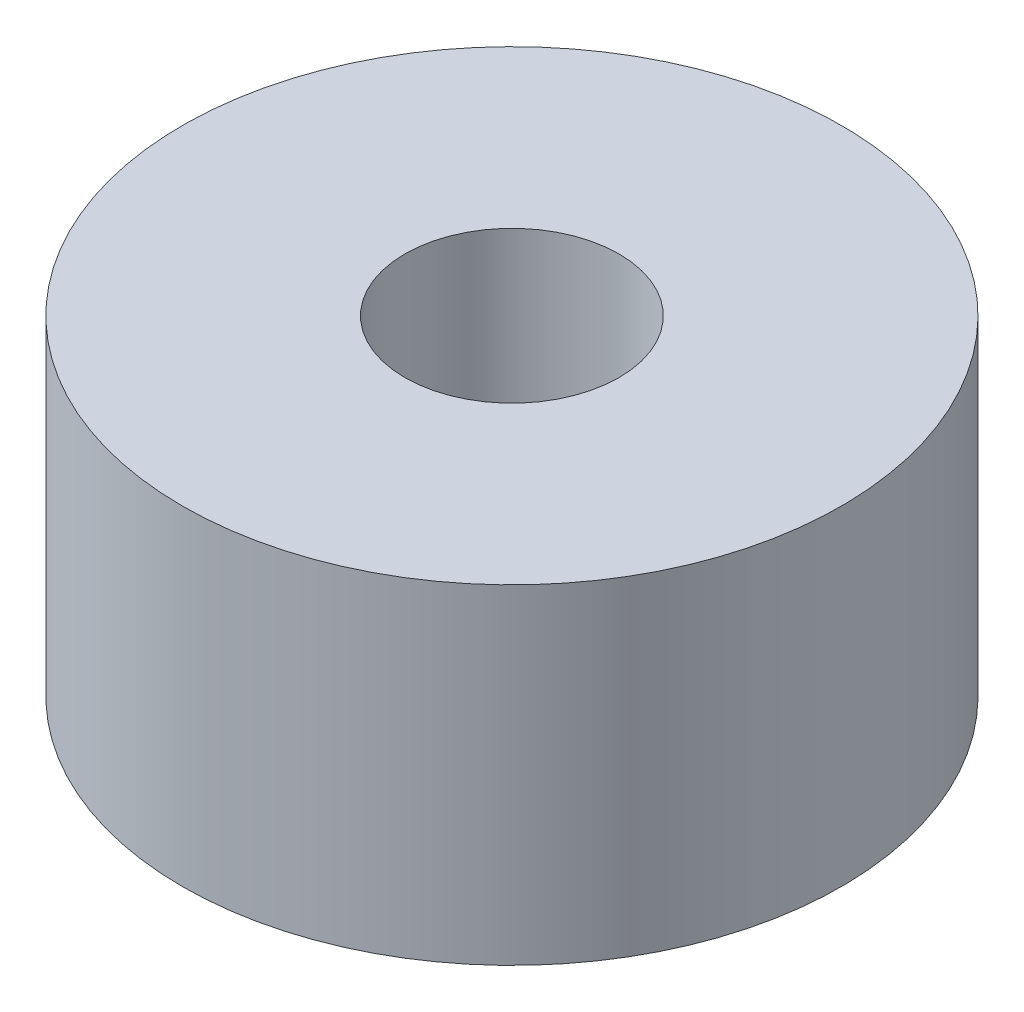
ISO-10303-21;
HEADER;
FILE_DESCRIPTION(('STEP AP214'),'2;1');
FILE_NAME('part.step','',(''),(''),'','','');
FILE_SCHEMA(('AUTOMOTIVE_DESIGN { 1 0 10303 214 1 1 1 1 }'));
ENDSEC;
DATA;
#1=APPLICATION_CONTEXT('core data for automotive mechanical design processes');
#2=APPLICATION_PROTOCOL_DEFINITION('international standard','automotive_design',2000,#1);
#3=PRODUCT_CONTEXT('',#1,'mechanical');
#4=PRODUCT('Part','Part','',(#3));
#5=PRODUCT_RELATED_PRODUCT_CATEGORY('part','',(#4));
#6=PRODUCT_DEFINITION_FORMATION('','',#4);
#7=PRODUCT_DEFINITION_CONTEXT('part definition',#1,'design');
#8=PRODUCT_DEFINITION('design','',#6,#7);
#9=PRODUCT_DEFINITION_SHAPE('','',#8);
#10=(LENGTH_UNIT() NAMED_UNIT(*) SI_UNIT(.MILLI.,.METRE.));
#11=(NAMED_UNIT(*) PLANE_ANGLE_UNIT() SI_UNIT($,.RADIAN.));
#12=(NAMED_UNIT(*) SI_UNIT($,.STERADIAN.) SOLID_ANGLE_UNIT());
#13=UNCERTAINTY_MEASURE_WITH_UNIT(LENGTH_MEASURE(1.E-05),#10,'distance_accuracy_value','');
#14=(GEOMETRIC_REPRESENTATION_CONTEXT(3) GLOBAL_UNCERTAINTY_ASSIGNED_CONTEXT((#13)) GLOBAL_UNIT_ASSIGNED_CONTEXT((#10,
#11,#12)) REPRESENTATION_CONTEXT('',''));
#15=CARTESIAN_POINT('',(0.,0.,0.));
#16=DIRECTION('',(0.,0.,1.));
#17=DIRECTION('',(1.,0.,0.));
#18=AXIS2_PLACEMENT_3D('',#15,#16,#17);
#19=CARTESIAN_POINT('',(0.,10.,0.));
#20=DIRECTION('',(0.,1.,0.));
#21=DIRECTION('',(0.,0.,1.));
#22=AXIS2_PLACEMENT_3D('',#19,#20,#21);
#23=PLANE('',#22);
#24=CARTESIAN_POINT('',(0.,10.,0.));
#25=DIRECTION('',(0.,1.,0.));
#26=DIRECTION('',(0.,0.,1.));
#27=AXIS2_PLACEMENT_3D('',#24,#25,#26);
#28=CIRCLE('',#27,10.);
#29=CARTESIAN_POINT('',(0.,10.,10.));
#30=VERTEX_POINT('',#29);
#31=EDGE_CURVE('E10',#30,#30,#28,.T.);
#32=ORIENTED_EDGE('',*,*,#31,.T.);
#33=EDGE_LOOP('',(#32));
#34=FACE_BOUND('',#33,.T.);
#35=CARTESIAN_POINT('',(0.,10.,0.));
#36=DIRECTION('',(0.,1.,0.));
#37=DIRECTION('',(0.,0.,1.));
#38=AXIS2_PLACEMENT_3D('',#35,#36,#37);
#39=CIRCLE('',#38,3.25);
#40=CARTESIAN_POINT('',(0.,10.,3.25));
#41=VERTEX_POINT('',#40);
#42=EDGE_CURVE('E50',#41,#41,#39,.T.);
#43=ORIENTED_EDGE('',*,*,#42,.F.);
#44=EDGE_LOOP('',(#43));
#45=FACE_BOUND('',#44,.T.);
#46=ADVANCED_FACE('F37',(#34,#45),#23,.T.);
#47=CARTESIAN_POINT('',(0.,0.,0.));
#48=DIRECTION('',(0.,1.,0.));
#49=DIRECTION('',(0.,0.,1.));
#50=AXIS2_PLACEMENT_3D('',#47,#48,#49);
#51=PLANE('',#50);
#52=CARTESIAN_POINT('',(0.,0.,0.));
#53=DIRECTION('',(0.,1.,0.));
#54=DIRECTION('',(0.,0.,1.));
#55=AXIS2_PLACEMENT_3D('',#52,#53,#54);
#56=CIRCLE('',#55,10.);
#57=CARTESIAN_POINT('',(0.,0.,10.));
#58=VERTEX_POINT('',#57);
#59=EDGE_CURVE('E41',#58,#58,#56,.T.);
#60=ORIENTED_EDGE('',*,*,#59,.F.);
#61=EDGE_LOOP('',(#60));
#62=FACE_BOUND('',#61,.T.);
#63=CARTESIAN_POINT('',(0.,0.,0.));
#64=DIRECTION('',(0.,1.,0.));
#65=DIRECTION('',(0.,0.,1.));
#66=AXIS2_PLACEMENT_3D('',#63,#64,#65);
#67=CIRCLE('',#66,3.25);
#68=CARTESIAN_POINT('',(0.,0.,3.25));
#69=VERTEX_POINT('',#68);
#70=EDGE_CURVE('E52',#69,#69,#67,.T.);
#71=ORIENTED_EDGE('',*,*,#70,.T.);
#72=EDGE_LOOP('',(#71));
#73=FACE_BOUND('',#72,.T.);
#74=ADVANCED_FACE('F64',(#62,#73),#51,.F.);
#75=CARTESIAN_POINT('',(0.,10.,0.));
#76=DIRECTION('',(0.,-1.,0.));
#77=DIRECTION('',(0.,0.,-1.));
#78=AXIS2_PLACEMENT_3D('',#75,#76,#77);
#79=CYLINDRICAL_SURFACE('',#78,10.);
#80=ORIENTED_EDGE('',*,*,#31,.F.);
#81=EDGE_LOOP('',(#80));
#82=FACE_BOUND('',#81,.T.);
#83=ORIENTED_EDGE('',*,*,#59,.T.);
#84=EDGE_LOOP('',(#83));
#85=FACE_BOUND('',#84,.T.);
#86=ADVANCED_FACE('F39',(#82,#85),#79,.T.);
#87=CARTESIAN_POINT('',(0.,10.,0.));
#88=DIRECTION('',(0.,-1.,0.));
#89=DIRECTION('',(0.,0.,-1.));
#90=AXIS2_PLACEMENT_3D('',#87,#88,#89);
#91=CYLINDRICAL_SURFACE('',#90,3.25);
#92=ORIENTED_EDGE('',*,*,#42,.T.);
#93=EDGE_LOOP('',(#92));
#94=FACE_BOUND('',#93,.T.);
#95=ORIENTED_EDGE('',*,*,#70,.F.);
#96=EDGE_LOOP('',(#95));
#97=FACE_BOUND('',#96,.T.);
#98=ADVANCED_FACE('F60',(#94,#97),#91,.F.);
#99=CLOSED_SHELL('',(#46,#74,#86,#98));
#100=MANIFOLD_SOLID_BREP('B2',#99);
#101=ADVANCED_BREP_SHAPE_REPRESENTATION('',(#18,#100),#14);
#102=SHAPE_DEFINITION_REPRESENTATION(#9,#101);
ENDSEC;
END-ISO-10303-21;
